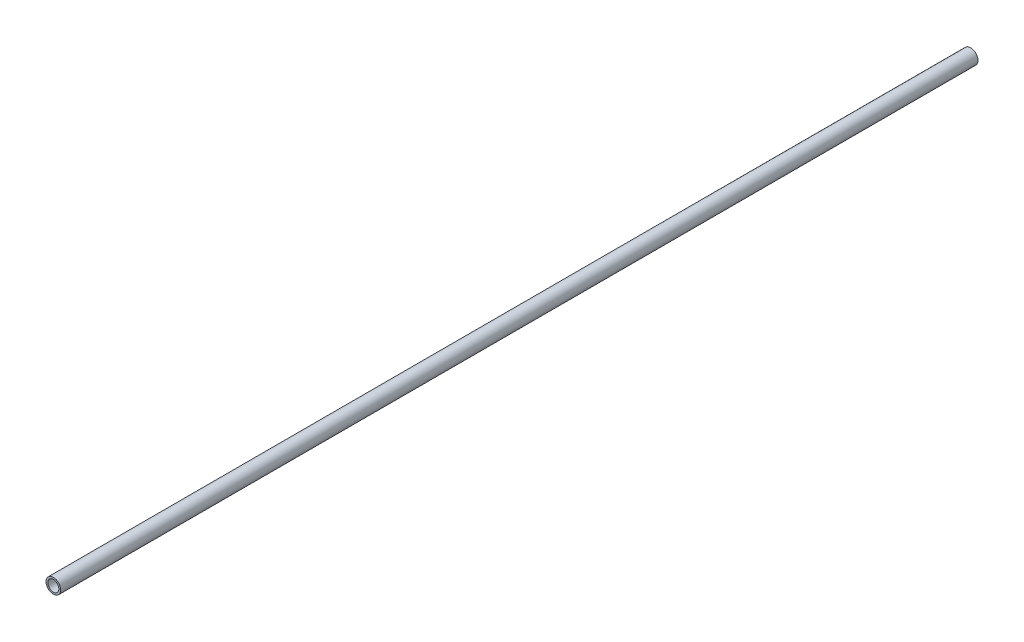
ISO-10303-21;
HEADER;
FILE_DESCRIPTION(('STEP AP214'),'2;1');
FILE_NAME('part.step','',(''),(''),'','','');
FILE_SCHEMA(('AUTOMOTIVE_DESIGN { 1 0 10303 214 1 1 1 1 }'));
ENDSEC;
DATA;
#1=APPLICATION_CONTEXT('core data for automotive mechanical design processes');
#2=APPLICATION_PROTOCOL_DEFINITION('international standard','automotive_design',2000,#1);
#3=PRODUCT_CONTEXT('',#1,'mechanical');
#4=PRODUCT('Part','Part','',(#3));
#5=PRODUCT_RELATED_PRODUCT_CATEGORY('part','',(#4));
#6=PRODUCT_DEFINITION_FORMATION('','',#4);
#7=PRODUCT_DEFINITION_CONTEXT('part definition',#1,'design');
#8=PRODUCT_DEFINITION('design','',#6,#7);
#9=PRODUCT_DEFINITION_SHAPE('','',#8);
#10=(LENGTH_UNIT() NAMED_UNIT(*) SI_UNIT(.MILLI.,.METRE.));
#11=(NAMED_UNIT(*) PLANE_ANGLE_UNIT() SI_UNIT($,.RADIAN.));
#12=(NAMED_UNIT(*) SI_UNIT($,.STERADIAN.) SOLID_ANGLE_UNIT());
#13=UNCERTAINTY_MEASURE_WITH_UNIT(LENGTH_MEASURE(1.E-05),#10,'distance_accuracy_value','');
#14=(GEOMETRIC_REPRESENTATION_CONTEXT(3) GLOBAL_UNCERTAINTY_ASSIGNED_CONTEXT((#13)) GLOBAL_UNIT_ASSIGNED_CONTEXT((#10,
#11,#12)) REPRESENTATION_CONTEXT('',''));
#15=CARTESIAN_POINT('',(0.,0.,0.));
#16=DIRECTION('',(0.,0.,1.));
#17=DIRECTION('',(1.,0.,0.));
#18=AXIS2_PLACEMENT_3D('',#15,#16,#17);
#19=CARTESIAN_POINT('',(0.,0.,250.));
#20=DIRECTION('',(0.,0.,1.));
#21=DIRECTION('',(1.,0.,0.));
#22=AXIS2_PLACEMENT_3D('',#19,#20,#21);
#23=PLANE('',#22);
#24=CARTESIAN_POINT('',(0.,0.,250.));
#25=DIRECTION('',(0.,0.,1.));
#26=DIRECTION('',(1.,0.,0.));
#27=AXIS2_PLACEMENT_3D('',#24,#25,#26);
#28=CIRCLE('',#27,4.);
#29=CARTESIAN_POINT('',(4.,0.,250.));
#30=VERTEX_POINT('',#29);
#31=EDGE_CURVE('E10',#30,#30,#28,.T.);
#32=ORIENTED_EDGE('',*,*,#31,.T.);
#33=EDGE_LOOP('',(#32));
#34=FACE_BOUND('',#33,.T.);
#35=CARTESIAN_POINT('',(0.,0.,250.));
#36=DIRECTION('',(0.,0.,1.));
#37=DIRECTION('',(1.,0.,0.));
#38=AXIS2_PLACEMENT_3D('',#35,#36,#37);
#39=CIRCLE('',#38,3.);
#40=CARTESIAN_POINT('',(3.,0.,250.));
#41=VERTEX_POINT('',#40);
#42=EDGE_CURVE('E50',#41,#41,#39,.T.);
#43=ORIENTED_EDGE('',*,*,#42,.F.);
#44=EDGE_LOOP('',(#43));
#45=FACE_BOUND('',#44,.T.);
#46=ADVANCED_FACE('F37',(#34,#45),#23,.T.);
#47=CARTESIAN_POINT('',(0.,0.,-250.));
#48=DIRECTION('',(0.,0.,1.));
#49=DIRECTION('',(1.,0.,0.));
#50=AXIS2_PLACEMENT_3D('',#47,#48,#49);
#51=PLANE('',#50);
#52=CARTESIAN_POINT('',(0.,0.,-250.));
#53=DIRECTION('',(0.,0.,1.));
#54=DIRECTION('',(1.,0.,0.));
#55=AXIS2_PLACEMENT_3D('',#52,#53,#54);
#56=CIRCLE('',#55,4.);
#57=CARTESIAN_POINT('',(4.,0.,-250.));
#58=VERTEX_POINT('',#57);
#59=EDGE_CURVE('E41',#58,#58,#56,.T.);
#60=ORIENTED_EDGE('',*,*,#59,.F.);
#61=EDGE_LOOP('',(#60));
#62=FACE_BOUND('',#61,.T.);
#63=CARTESIAN_POINT('',(0.,0.,-250.));
#64=DIRECTION('',(0.,0.,1.));
#65=DIRECTION('',(1.,0.,0.));
#66=AXIS2_PLACEMENT_3D('',#63,#64,#65);
#67=CIRCLE('',#66,3.);
#68=CARTESIAN_POINT('',(3.,0.,-250.));
#69=VERTEX_POINT('',#68);
#70=EDGE_CURVE('E52',#69,#69,#67,.T.);
#71=ORIENTED_EDGE('',*,*,#70,.T.);
#72=EDGE_LOOP('',(#71));
#73=FACE_BOUND('',#72,.T.);
#74=ADVANCED_FACE('F64',(#62,#73),#51,.F.);
#75=CARTESIAN_POINT('',(0.,0.,250.));
#76=DIRECTION('',(0.,0.,-1.));
#77=DIRECTION('',(-1.,0.,0.));
#78=AXIS2_PLACEMENT_3D('',#75,#76,#77);
#79=CYLINDRICAL_SURFACE('',#78,4.);
#80=ORIENTED_EDGE('',*,*,#31,.F.);
#81=EDGE_LOOP('',(#80));
#82=FACE_BOUND('',#81,.T.);
#83=ORIENTED_EDGE('',*,*,#59,.T.);
#84=EDGE_LOOP('',(#83));
#85=FACE_BOUND('',#84,.T.);
#86=ADVANCED_FACE('F39',(#82,#85),#79,.T.);
#87=CARTESIAN_POINT('',(0.,0.,250.));
#88=DIRECTION('',(0.,0.,-1.));
#89=DIRECTION('',(-1.,0.,0.));
#90=AXIS2_PLACEMENT_3D('',#87,#88,#89);
#91=CYLINDRICAL_SURFACE('',#90,3.);
#92=ORIENTED_EDGE('',*,*,#42,.T.);
#93=EDGE_LOOP('',(#92));
#94=FACE_BOUND('',#93,.T.);
#95=ORIENTED_EDGE('',*,*,#70,.F.);
#96=EDGE_LOOP('',(#95));
#97=FACE_BOUND('',#96,.T.);
#98=ADVANCED_FACE('F60',(#94,#97),#91,.F.);
#99=CLOSED_SHELL('',(#46,#74,#86,#98));
#100=MANIFOLD_SOLID_BREP('B2',#99);
#101=ADVANCED_BREP_SHAPE_REPRESENTATION('',(#18,#100),#14);
#102=SHAPE_DEFINITION_REPRESENTATION(#9,#101);
ENDSEC;
END-ISO-10303-21;
